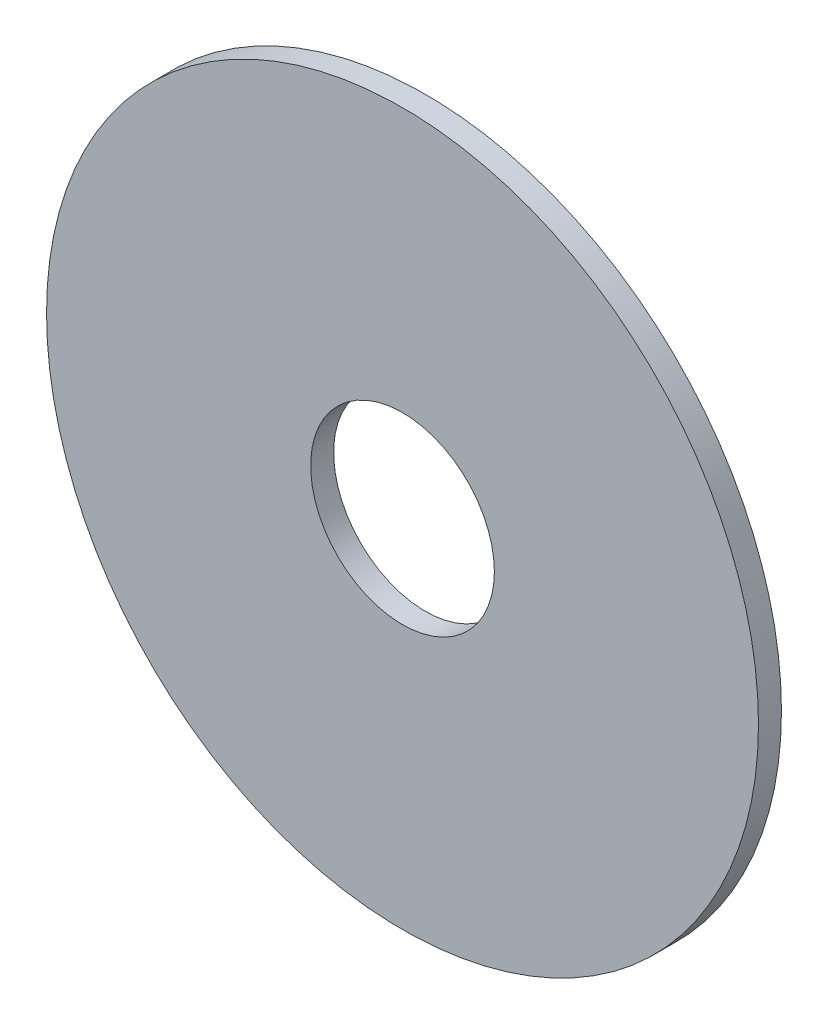
ISO-10303-21;
HEADER;
FILE_DESCRIPTION(('STEP AP214'),'2;1');
FILE_NAME('part.step','',(''),(''),'','','');
FILE_SCHEMA(('AUTOMOTIVE_DESIGN { 1 0 10303 214 1 1 1 1 }'));
ENDSEC;
DATA;
#1=APPLICATION_CONTEXT('core data for automotive mechanical design processes');
#2=APPLICATION_PROTOCOL_DEFINITION('international standard','automotive_design',2000,#1);
#3=PRODUCT_CONTEXT('',#1,'mechanical');
#4=PRODUCT('Part','Part','',(#3));
#5=PRODUCT_RELATED_PRODUCT_CATEGORY('part','',(#4));
#6=PRODUCT_DEFINITION_FORMATION('','',#4);
#7=PRODUCT_DEFINITION_CONTEXT('part definition',#1,'design');
#8=PRODUCT_DEFINITION('design','',#6,#7);
#9=PRODUCT_DEFINITION_SHAPE('','',#8);
#10=(LENGTH_UNIT() NAMED_UNIT(*) SI_UNIT(.MILLI.,.METRE.));
#11=(NAMED_UNIT(*) PLANE_ANGLE_UNIT() SI_UNIT($,.RADIAN.));
#12=(NAMED_UNIT(*) SI_UNIT($,.STERADIAN.) SOLID_ANGLE_UNIT());
#13=UNCERTAINTY_MEASURE_WITH_UNIT(LENGTH_MEASURE(1.E-05),#10,'distance_accuracy_value','');
#14=(GEOMETRIC_REPRESENTATION_CONTEXT(3) GLOBAL_UNCERTAINTY_ASSIGNED_CONTEXT((#13)) GLOBAL_UNIT_ASSIGNED_CONTEXT((#10,
#11,#12)) REPRESENTATION_CONTEXT('',''));
#15=CARTESIAN_POINT('',(0.,0.,0.));
#16=DIRECTION('',(0.,0.,1.));
#17=DIRECTION('',(1.,0.,0.));
#18=AXIS2_PLACEMENT_3D('',#15,#16,#17);
#19=CARTESIAN_POINT('',(0.,0.,0.25));
#20=DIRECTION('',(0.,0.,1.));
#21=DIRECTION('',(1.,0.,0.));
#22=AXIS2_PLACEMENT_3D('',#19,#20,#21);
#23=PLANE('',#22);
#24=CARTESIAN_POINT('',(0.,0.,0.25));
#25=DIRECTION('',(0.,0.,1.));
#26=DIRECTION('',(1.,0.,0.));
#27=AXIS2_PLACEMENT_3D('',#24,#25,#26);
#28=CIRCLE('',#27,3.875);
#29=CARTESIAN_POINT('',(3.875,0.,0.25));
#30=VERTEX_POINT('',#29);
#31=EDGE_CURVE('E10',#30,#30,#28,.T.);
#32=ORIENTED_EDGE('',*,*,#31,.T.);
#33=EDGE_LOOP('',(#32));
#34=FACE_BOUND('',#33,.T.);
#35=CARTESIAN_POINT('',(0.,0.,0.25));
#36=DIRECTION('',(0.,0.,1.));
#37=DIRECTION('',(1.,0.,0.));
#38=AXIS2_PLACEMENT_3D('',#35,#36,#37);
#39=CIRCLE('',#38,1.);
#40=CARTESIAN_POINT('',(1.,0.,0.25));
#41=VERTEX_POINT('',#40);
#42=EDGE_CURVE('E45',#41,#41,#39,.T.);
#43=ORIENTED_EDGE('',*,*,#42,.F.);
#44=EDGE_LOOP('',(#43));
#45=FACE_BOUND('',#44,.T.);
#46=ADVANCED_FACE('F34',(#34,#45),#23,.T.);
#47=CARTESIAN_POINT('',(0.,0.,0.));
#48=DIRECTION('',(0.,0.,1.));
#49=DIRECTION('',(1.,0.,0.));
#50=AXIS2_PLACEMENT_3D('',#47,#48,#49);
#51=PLANE('',#50);
#52=CARTESIAN_POINT('',(0.,0.,0.));
#53=DIRECTION('',(0.,0.,1.));
#54=DIRECTION('',(1.,0.,0.));
#55=AXIS2_PLACEMENT_3D('',#52,#53,#54);
#56=CIRCLE('',#55,3.875);
#57=CARTESIAN_POINT('',(3.875,0.,0.));
#58=VERTEX_POINT('',#57);
#59=EDGE_CURVE('E38',#58,#58,#56,.T.);
#60=ORIENTED_EDGE('',*,*,#59,.F.);
#61=EDGE_LOOP('',(#60));
#62=FACE_BOUND('',#61,.T.);
#63=CARTESIAN_POINT('',(0.,0.,0.));
#64=DIRECTION('',(0.,0.,1.));
#65=DIRECTION('',(1.,0.,0.));
#66=AXIS2_PLACEMENT_3D('',#63,#64,#65);
#67=CIRCLE('',#66,1.);
#68=CARTESIAN_POINT('',(1.,0.,0.));
#69=VERTEX_POINT('',#68);
#70=EDGE_CURVE('E47',#69,#69,#67,.T.);
#71=ORIENTED_EDGE('',*,*,#70,.T.);
#72=EDGE_LOOP('',(#71));
#73=FACE_BOUND('',#72,.T.);
#74=ADVANCED_FACE('F57',(#62,#73),#51,.F.);
#75=CARTESIAN_POINT('',(0.,0.,0.25));
#76=DIRECTION('',(0.,0.,-1.));
#77=DIRECTION('',(-1.,0.,0.));
#78=AXIS2_PLACEMENT_3D('',#75,#76,#77);
#79=CYLINDRICAL_SURFACE('',#78,3.875);
#80=ORIENTED_EDGE('',*,*,#31,.F.);
#81=EDGE_LOOP('',(#80));
#82=FACE_BOUND('',#81,.T.);
#83=ORIENTED_EDGE('',*,*,#59,.T.);
#84=EDGE_LOOP('',(#83));
#85=FACE_BOUND('',#84,.T.);
#86=ADVANCED_FACE('F36',(#82,#85),#79,.T.);
#87=CARTESIAN_POINT('',(0.,0.,0.25));
#88=DIRECTION('',(0.,0.,-1.));
#89=DIRECTION('',(-1.,0.,0.));
#90=AXIS2_PLACEMENT_3D('',#87,#88,#89);
#91=CYLINDRICAL_SURFACE('',#90,1.);
#92=ORIENTED_EDGE('',*,*,#42,.T.);
#93=EDGE_LOOP('',(#92));
#94=FACE_BOUND('',#93,.T.);
#95=ORIENTED_EDGE('',*,*,#70,.F.);
#96=EDGE_LOOP('',(#95));
#97=FACE_BOUND('',#96,.T.);
#98=ADVANCED_FACE('F53',(#94,#97),#91,.F.);
#99=CLOSED_SHELL('',(#46,#74,#86,#98));
#100=MANIFOLD_SOLID_BREP('B2',#99);
#101=ADVANCED_BREP_SHAPE_REPRESENTATION('',(#18,#100),#14);
#102=SHAPE_DEFINITION_REPRESENTATION(#9,#101);
ENDSEC;
END-ISO-10303-21;
